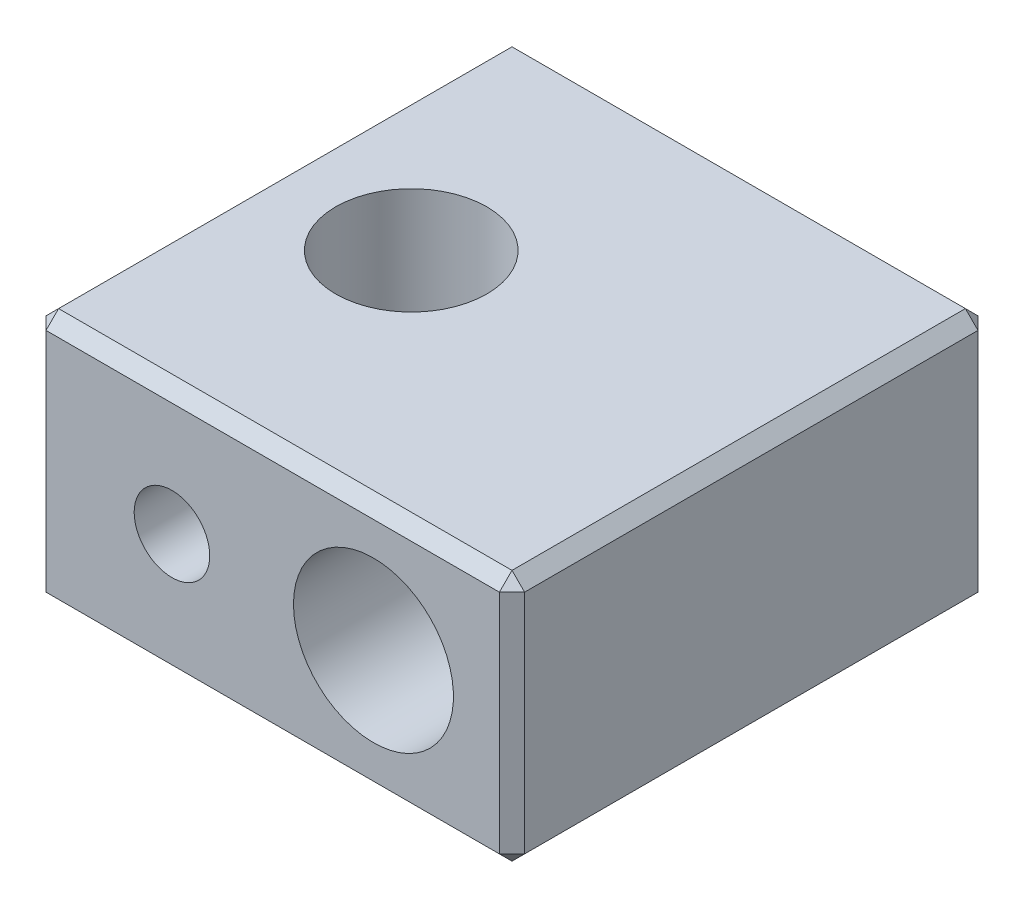
ISO-10303-21;
HEADER;
FILE_DESCRIPTION(('STEP AP214'),'2;1');
FILE_NAME('part.step','',(''),(''),'','','');
FILE_SCHEMA(('AUTOMOTIVE_DESIGN { 1 0 10303 214 1 1 1 1 }'));
ENDSEC;
DATA;
#1=APPLICATION_CONTEXT('core data for automotive mechanical design processes');
#2=APPLICATION_PROTOCOL_DEFINITION('international standard','automotive_design',2000,#1);
#3=PRODUCT_CONTEXT('',#1,'mechanical');
#4=PRODUCT('Part','Part','',(#3));
#5=PRODUCT_RELATED_PRODUCT_CATEGORY('part','',(#4));
#6=PRODUCT_DEFINITION_FORMATION('','',#4);
#7=PRODUCT_DEFINITION_CONTEXT('part definition',#1,'design');
#8=PRODUCT_DEFINITION('design','',#6,#7);
#9=PRODUCT_DEFINITION_SHAPE('','',#8);
#10=(LENGTH_UNIT() NAMED_UNIT(*) SI_UNIT(.MILLI.,.METRE.));
#11=(NAMED_UNIT(*) PLANE_ANGLE_UNIT() SI_UNIT($,.RADIAN.));
#12=(NAMED_UNIT(*) SI_UNIT($,.STERADIAN.) SOLID_ANGLE_UNIT());
#13=UNCERTAINTY_MEASURE_WITH_UNIT(LENGTH_MEASURE(1.E-05),#10,'distance_accuracy_value','');
#14=(GEOMETRIC_REPRESENTATION_CONTEXT(3) GLOBAL_UNCERTAINTY_ASSIGNED_CONTEXT((#13)) GLOBAL_UNIT_ASSIGNED_CONTEXT((#10,
#11,#12)) REPRESENTATION_CONTEXT('',''));
#15=CARTESIAN_POINT('',(0.,0.,0.));
#16=DIRECTION('',(0.,0.,1.));
#17=DIRECTION('',(1.,0.,0.));
#18=AXIS2_PLACEMENT_3D('',#15,#16,#17);
#19=CARTESIAN_POINT('',(-9.5,10.,9.5));
#20=DIRECTION('',(0.,0.,-1.));
#21=DIRECTION('',(-1.,0.,0.));
#22=AXIS2_PLACEMENT_3D('',#19,#20,#21);
#23=PLANE('',#22);
#24=DIRECTION('',(0.,-1.,0.));
#25=VECTOR('',#24,1.);
#26=CARTESIAN_POINT('',(-8.99999999999999,10.,9.5));
#27=LINE('',#26,#25);
#28=CARTESIAN_POINT('',(-8.99999999999999,9.49999999999999,9.5));
#29=VERTEX_POINT('',#28);
#30=CARTESIAN_POINT('',(-8.99999999999999,0.500000000000004,9.5));
#31=VERTEX_POINT('',#30);
#32=EDGE_CURVE('E130',#29,#31,#27,.T.);
#33=ORIENTED_EDGE('',*,*,#32,.T.);
#34=DIRECTION('',(1.,0.,0.));
#35=VECTOR('',#34,1.);
#36=CARTESIAN_POINT('',(-9.5,0.500000000000004,9.5));
#37=LINE('',#36,#35);
#38=CARTESIAN_POINT('',(8.99999999999999,0.500000000000004,9.5));
#39=VERTEX_POINT('',#38);
#40=EDGE_CURVE('E126',#31,#39,#37,.T.);
#41=ORIENTED_EDGE('',*,*,#40,.T.);
#42=DIRECTION('',(0.,1.,0.));
#43=VECTOR('',#42,1.);
#44=CARTESIAN_POINT('',(8.99999999999999,10.,9.5));
#45=LINE('',#44,#43);
#46=CARTESIAN_POINT('',(8.99999999999999,9.49999999999999,9.5));
#47=VERTEX_POINT('',#46);
#48=EDGE_CURVE('E120',#39,#47,#45,.T.);
#49=ORIENTED_EDGE('',*,*,#48,.T.);
#50=DIRECTION('',(-1.,0.,0.));
#51=VECTOR('',#50,1.);
#52=CARTESIAN_POINT('',(-9.5,9.49999999999999,9.5));
#53=LINE('',#52,#51);
#54=EDGE_CURVE('E123',#47,#29,#53,.T.);
#55=ORIENTED_EDGE('',*,*,#54,.T.);
#56=EDGE_LOOP('',(#33,#41,#49,#55));
#57=FACE_BOUND('',#56,.T.);
#58=CARTESIAN_POINT('',(4.,5.,9.5));
#59=DIRECTION('',(0.,0.,-1.));
#60=DIRECTION('',(-1.,0.,0.));
#61=AXIS2_PLACEMENT_3D('',#58,#59,#60);
#62=CIRCLE('',#61,3.175);
#63=CARTESIAN_POINT('',(0.824999999999998,5.,9.5));
#64=VERTEX_POINT('',#63);
#65=EDGE_CURVE('E223',#64,#64,#62,.T.);
#66=ORIENTED_EDGE('',*,*,#65,.T.);
#67=EDGE_LOOP('',(#66));
#68=FACE_BOUND('',#67,.T.);
#69=CARTESIAN_POINT('',(-4.,5.,9.5));
#70=DIRECTION('',(0.,0.,-1.));
#71=DIRECTION('',(-1.,0.,0.));
#72=AXIS2_PLACEMENT_3D('',#69,#70,#71);
#73=CIRCLE('',#72,1.5);
#74=CARTESIAN_POINT('',(-5.5,5.,9.5));
#75=VERTEX_POINT('',#74);
#76=EDGE_CURVE('E199',#75,#75,#73,.T.);
#77=ORIENTED_EDGE('',*,*,#76,.T.);
#78=EDGE_LOOP('',(#77));
#79=FACE_BOUND('',#78,.T.);
#80=ADVANCED_FACE('F32',(#57,#68,#79),#23,.F.);
#81=CARTESIAN_POINT('',(9.5,0.,9.5));
#82=DIRECTION('',(0.,1.,0.));
#83=DIRECTION('',(0.,0.,1.));
#84=AXIS2_PLACEMENT_3D('',#81,#82,#83);
#85=PLANE('',#84);
#86=DIRECTION('',(0.,0.,1.));
#87=VECTOR('',#86,1.);
#88=CARTESIAN_POINT('',(9.,0.,9.5));
#89=LINE('',#88,#87);
#90=CARTESIAN_POINT('',(8.99999999999999,0.,-8.99999999999999));
#91=VERTEX_POINT('',#90);
#92=CARTESIAN_POINT('',(9.,0.,8.99999999999999));
#93=VERTEX_POINT('',#92);
#94=EDGE_CURVE('E359',#91,#93,#89,.T.);
#95=ORIENTED_EDGE('',*,*,#94,.T.);
#96=DIRECTION('',(-1.,0.,0.));
#97=VECTOR('',#96,1.);
#98=CARTESIAN_POINT('',(9.5,0.,8.99999999999999));
#99=LINE('',#98,#97);
#100=CARTESIAN_POINT('',(-8.99999999999999,0.,8.99999999999999));
#101=VERTEX_POINT('',#100);
#102=EDGE_CURVE('E361',#93,#101,#99,.T.);
#103=ORIENTED_EDGE('',*,*,#102,.T.);
#104=DIRECTION('',(0.,0.,-1.));
#105=VECTOR('',#104,1.);
#106=CARTESIAN_POINT('',(-8.99999999999999,0.,9.5));
#107=LINE('',#106,#105);
#108=CARTESIAN_POINT('',(-8.99999999999999,0.,-8.99999999999999));
#109=VERTEX_POINT('',#108);
#110=EDGE_CURVE('E355',#101,#109,#107,.T.);
#111=ORIENTED_EDGE('',*,*,#110,.T.);
#112=DIRECTION('',(1.,0.,0.));
#113=VECTOR('',#112,1.);
#114=CARTESIAN_POINT('',(9.5,0.,-8.99999999999999));
#115=LINE('',#114,#113);
#116=EDGE_CURVE('E357',#109,#91,#115,.T.);
#117=ORIENTED_EDGE('',*,*,#116,.T.);
#118=EDGE_LOOP('',(#95,#103,#111,#117));
#119=FACE_BOUND('',#118,.T.);
#120=CARTESIAN_POINT('',(-4.,0.,0.));
#121=DIRECTION('',(0.,-1.,0.));
#122=DIRECTION('',(0.,0.,-1.));
#123=AXIS2_PLACEMENT_3D('',#120,#121,#122);
#124=CIRCLE('',#123,3.25);
#125=CARTESIAN_POINT('',(-4.,0.,-3.25));
#126=VERTEX_POINT('',#125);
#127=EDGE_CURVE('E425',#126,#126,#124,.T.);
#128=ORIENTED_EDGE('',*,*,#127,.F.);
#129=EDGE_LOOP('',(#128));
#130=FACE_BOUND('',#129,.T.);
#131=CARTESIAN_POINT('',(4.,0.,0.));
#132=DIRECTION('',(0.,1.,0.));
#133=DIRECTION('',(0.,0.,1.));
#134=AXIS2_PLACEMENT_3D('',#131,#132,#133);
#135=CIRCLE('',#134,1.5);
#136=CARTESIAN_POINT('',(4.,0.,1.5));
#137=VERTEX_POINT('',#136);
#138=EDGE_CURVE('E213',#137,#137,#135,.T.);
#139=ORIENTED_EDGE('',*,*,#138,.T.);
#140=EDGE_LOOP('',(#139));
#141=FACE_BOUND('',#140,.T.);
#142=ADVANCED_FACE('F244',(#119,#130,#141),#85,.F.);
#143=CARTESIAN_POINT('',(4.,5.,9.5));
#144=DIRECTION('',(0.,0.,-1.));
#145=DIRECTION('',(-1.,0.,0.));
#146=AXIS2_PLACEMENT_3D('',#143,#144,#145);
#147=CYLINDRICAL_SURFACE('',#146,3.175);
#148=CARTESIAN_POINT('',(4.,5.,-9.5));
#149=DIRECTION('',(0.,0.,-1.));
#150=DIRECTION('',(-1.,0.,0.));
#151=AXIS2_PLACEMENT_3D('',#148,#149,#150);
#152=CIRCLE('',#151,3.175);
#153=CARTESIAN_POINT('',(0.824999999999998,5.,-9.5));
#154=VERTEX_POINT('',#153);
#155=EDGE_CURVE('E216',#154,#154,#152,.T.);
#156=ORIENTED_EDGE('',*,*,#155,.T.);
#157=EDGE_LOOP('',(#156));
#158=FACE_BOUND('',#157,.T.);
#159=ORIENTED_EDGE('',*,*,#65,.F.);
#160=EDGE_LOOP('',(#159));
#161=FACE_BOUND('',#160,.T.);
#162=CARTESIAN_POINT('',(4.,1.825,-1.5));
#163=CARTESIAN_POINT('',(4.07936960563319,1.82500378014705,-1.49999552610351));
#164=CARTESIAN_POINT('',(4.15884896621332,1.82800879629186,-1.49366335348419));
#165=CARTESIAN_POINT('',(4.3154907966577,1.83973237257584,-1.46859961285751));
#166=CARTESIAN_POINT('',(4.39264787604167,1.84846329246751,-1.44984122112576));
#167=CARTESIAN_POINT('',(4.54213461401645,1.8707181485981,-1.40080463386028));
#168=CARTESIAN_POINT('',(4.61448113482697,1.88422416603307,-1.37056947468804));
#169=CARTESIAN_POINT('',(4.75298275747988,1.91476442442062,-1.29964446831745));
#170=CARTESIAN_POINT('',(4.81913879873701,1.93179812877659,-1.25895621091422));
#171=CARTESIAN_POINT('',(4.94753197755139,1.96890784997548,-1.16568662754687));
#172=CARTESIAN_POINT('',(5.00934531536299,1.98910050392611,-1.11256891765261));
#173=CARTESIAN_POINT('',(5.12356872804672,2.02983122248948,-0.997094015418057));
#174=CARTESIAN_POINT('',(5.17597245123061,2.05036951025994,-0.934730633511468));
#175=CARTESIAN_POINT('',(5.27340721108708,2.09104265788839,-0.797484364549707));
#176=CARTESIAN_POINT('',(5.31770529611402,2.11105747093378,-0.722041543144826));
#177=CARTESIAN_POINT('',(5.39279860497068,2.14649805086367,-0.563714506050773));
#178=CARTESIAN_POINT('',(5.4236026358555,2.16192680877126,-0.480835186570921));
#179=CARTESIAN_POINT('',(5.46896762087975,2.18515018476853,-0.31481732997647));
#180=CARTESIAN_POINT('',(5.48434942407678,2.19332754828801,-0.231959104586468));
#181=CARTESIAN_POINT('',(5.50096994970779,2.20217709352757,-0.0644666996695347));
#182=CARTESIAN_POINT('',(5.50222015512641,2.20285536881031,0.0201659819400645));
#183=CARTESIAN_POINT('',(5.49114871052963,2.19694406736192,0.179375308597733));
#184=CARTESIAN_POINT('',(5.48022366031689,2.19110228775897,0.254083159444344));
#185=CARTESIAN_POINT('',(5.44750469243097,2.17410342089286,0.400444680864749));
#186=CARTESIAN_POINT('',(5.42570787921159,2.16294491762807,0.472097532259387));
#187=CARTESIAN_POINT('',(5.37144042107046,2.13631288920667,0.612321457252151));
#188=CARTESIAN_POINT('',(5.33873421633754,2.12074539557425,0.680782693270601));
#189=CARTESIAN_POINT('',(5.26375034917989,2.08705518759843,0.811555770691812));
#190=CARTESIAN_POINT('',(5.22146847336964,2.06893134976761,0.873864887721362));
#191=CARTESIAN_POINT('',(5.12301829304094,2.02972032691525,0.997886017898578));
#192=CARTESIAN_POINT('',(5.06582685913967,2.00852815825586,1.05875534173549));
#193=CARTESIAN_POINT('',(4.94191165452174,1.96723030755263,1.17036692101214));
#194=CARTESIAN_POINT('',(4.87518424052315,1.94712504483319,1.22110528801275));
#195=CARTESIAN_POINT('',(4.73090045194253,1.90934186811578,1.31276553049459));
#196=CARTESIAN_POINT('',(4.65303276474939,1.89178262065809,1.3532501250906));
#197=CARTESIAN_POINT('',(4.49054980640997,1.86204103438622,1.42023485274128));
#198=CARTESIAN_POINT('',(4.40593938939462,1.84985486801759,1.44674494327945));
#199=CARTESIAN_POINT('',(4.23932533118367,1.83301150614484,1.48304672169946));
#200=CARTESIAN_POINT('',(4.15761808537237,1.82784930363547,1.49396302225133));
#201=CARTESIAN_POINT('',(3.99337993762666,1.82394625691096,1.50223450172528));
#202=CARTESIAN_POINT('',(3.91084937990857,1.82520283284867,1.49959512896601));
#203=CARTESIAN_POINT('',(3.75320909524375,1.83368749574601,1.48154104977407));
#204=CARTESIAN_POINT('',(3.67797438273671,1.84050696101403,1.46700031787886));
#205=CARTESIAN_POINT('',(3.53114008861237,1.85893750143806,1.42687253370616));
#206=CARTESIAN_POINT('',(3.45954092924452,1.87054913175455,1.40128420157562));
#207=CARTESIAN_POINT('',(3.3195173353867,1.89793370999513,1.33902722401946));
#208=CARTESIAN_POINT('',(3.25125556630968,1.91382242394619,1.30204540414419));
#209=CARTESIAN_POINT('',(3.12166658688653,1.9481715735434,1.21839457445117));
#210=CARTESIAN_POINT('',(3.06034243754656,1.9666331364222,1.17172131414348));
#211=CARTESIAN_POINT('',(2.94055528499526,2.00625152384082,1.06515983569381));
#212=CARTESIAN_POINT('',(2.88284178298482,2.02750159498701,1.00446196991745));
#213=CARTESIAN_POINT('',(2.77812417836031,2.0689892973599,0.874079956626705));
#214=CARTESIAN_POINT('',(2.73112556156511,2.08922640584945,0.804391234425825));
#215=CARTESIAN_POINT('',(2.6476822639998,2.1270157776171,0.654841394300249));
#216=CARTESIAN_POINT('',(2.6116642516864,2.14444936754207,0.574709723149408));
#217=CARTESIAN_POINT('',(2.55400203348932,2.17320495906616,0.408424263919081));
#218=CARTESIAN_POINT('',(2.53234145021053,2.18453392139114,0.322277461718732));
#219=CARTESIAN_POINT('',(2.50583444641473,2.19851851692831,0.154863402906991));
#220=CARTESIAN_POINT('',(2.49963251148815,2.20187207176707,0.0738695282686648));
#221=CARTESIAN_POINT('',(2.5004008875279,2.20145924129458,-0.0880256718279041));
#222=CARTESIAN_POINT('',(2.50736721668871,2.19769500825225,-0.168927017863447));
#223=CARTESIAN_POINT('',(2.53304452543146,2.1841789062617,-0.321861858166745));
#224=CARTESIAN_POINT('',(2.55081637100025,2.17490706922987,-0.394100315708995));
#225=CARTESIAN_POINT('',(2.59652737888882,2.15192341830404,-0.53452895410737));
#226=CARTESIAN_POINT('',(2.62446960003733,2.13821026878362,-0.6027179098565));
#227=CARTESIAN_POINT('',(2.69183834096165,2.10676566636447,-0.738110551829189));
#228=CARTESIAN_POINT('',(2.73190592465991,2.0888273778811,-0.804945969560304));
#229=CARTESIAN_POINT('',(2.82161930265931,2.05137218308055,-0.931360798184328));
#230=CARTESIAN_POINT('',(2.87126967655845,2.03185452458563,-0.990936717479633));
#231=CARTESIAN_POINT('',(2.98481054622897,1.99101051160812,-1.1075560784686));
#232=CARTESIAN_POINT('',(3.04964445909147,1.96970684763495,-1.16369381341707));
#233=CARTESIAN_POINT('',(3.18849355379877,1.92960939228646,-1.26444175427494));
#234=CARTESIAN_POINT('',(3.26251314986984,1.91081681670608,-1.30904638589811));
#235=CARTESIAN_POINT('',(3.41768967664033,1.87785196490441,-1.3850463197749));
#236=CARTESIAN_POINT('',(3.49882070475343,1.86366373894684,-1.41648733383919));
#237=CARTESIAN_POINT('',(3.66595879751047,1.84150449210771,-1.46490242402554));
#238=CARTESIAN_POINT('',(3.7519506429211,1.83351510637885,-1.48191924759625));
#239=CARTESIAN_POINT('',(3.86555067251037,1.82773333825557,-1.49420643339842));
#240=CARTESIAN_POINT('',(3.89238024918377,1.82671048291779,-1.49637655199677));
#241=CARTESIAN_POINT('',(3.94613566805403,1.82534316483504,-1.49927411038089));
#242=CARTESIAN_POINT('',(3.97306151235319,1.82499871699697,-1.50000151846547));
#243=CARTESIAN_POINT('',(4.,1.825,-1.5));
#244=B_SPLINE_CURVE_WITH_KNOTS('',3,(#162,#163,#164,#165,#166,#167,#168,#169,#170,#171,#172,
#173,#174,#175,#176,#177,#178,#179,#180,#181,#182,#183,#184,#185,#186,#187,#188,#189,#190,#191,
#192,#193,#194,#195,#196,#197,#198,#199,#200,#201,#202,#203,#204,#205,#206,#207,#208,#209,#210,
#211,#212,#213,#214,#215,#216,#217,#218,#219,#220,#221,#222,#223,#224,#225,#226,#227,#228,#229,
#230,#231,#232,#233,#234,#235,#236,#237,#238,#239,#240,#241,#242,#243),.UNSPECIFIED.,.T.,.F.,(4,
2,2,2,2,2,2,2,2,2,2,2,2,2,2,2,2,2,2,2,2,2,2,2,2,2,2,2,2,2,2,2,2,2,2,2,2,2,2,2,4),(0.,
0.237998863435127,0.476513162034361,0.714141760487185,0.951734239756924,1.202566267352,
1.45356698050229,1.72144991719773,1.98915775546694,2.24170968929963,2.4940563909499,
2.72018464462581,2.94637315667184,3.17780125644152,3.40933138528568,3.66670059385932,
3.92416839616743,4.19124985366182,4.45814074508092,4.70459764976704,4.9509555058397,
5.18069145066332,5.41045401730286,5.6472008989094,5.88405183355053,6.14213867221335,
6.40035735120202,6.66760822573517,6.93455372246492,7.17710763594646,7.41958821796887,
7.64352093670395,7.86752106087492,8.10644389425159,8.34548119240929,8.60934561245708,
8.87333732850241,9.13640455025375,9.39868939422999,9.47946576344206,9.56024390756228),.UNSPECIFIED.);
#245=CARTESIAN_POINT('',(4.,1.825,-1.5));
#246=VERTEX_POINT('',#245);
#247=EDGE_CURVE('E210',#246,#246,#244,.T.);
#248=ORIENTED_EDGE('',*,*,#247,.T.);
#249=EDGE_LOOP('',(#248));
#250=FACE_BOUND('',#249,.T.);
#251=ADVANCED_FACE('F249',(#158,#161,#250),#147,.F.);
#252=CARTESIAN_POINT('',(-4.,10.,0.));
#253=DIRECTION('',(0.,-1.,0.));
#254=DIRECTION('',(0.,0.,-1.));
#255=AXIS2_PLACEMENT_3D('',#252,#253,#254);
#256=CYLINDRICAL_SURFACE('',#255,3.);
#257=CARTESIAN_POINT('',(-4.,10.,0.));
#258=DIRECTION('',(0.,1.,0.));
#259=DIRECTION('',(0.,0.,1.));
#260=AXIS2_PLACEMENT_3D('',#257,#258,#259);
#261=CIRCLE('',#260,3.);
#262=CARTESIAN_POINT('',(-4.,10.,3.));
#263=VERTEX_POINT('',#262);
#264=EDGE_CURVE('E141',#263,#263,#261,.T.);
#265=ORIENTED_EDGE('',*,*,#264,.T.);
#266=EDGE_LOOP('',(#265));
#267=FACE_BOUND('',#266,.T.);
#268=CARTESIAN_POINT('',(-4.,1.5,0.));
#269=DIRECTION('',(0.,-1.,0.));
#270=DIRECTION('',(0.,0.,-1.));
#271=AXIS2_PLACEMENT_3D('',#268,#269,#270);
#272=CIRCLE('',#271,3.);
#273=CARTESIAN_POINT('',(-4.,1.5,-3.));
#274=VERTEX_POINT('',#273);
#275=EDGE_CURVE('E430',#274,#274,#272,.T.);
#276=ORIENTED_EDGE('',*,*,#275,.T.);
#277=EDGE_LOOP('',(#276));
#278=FACE_BOUND('',#277,.T.);
#279=ADVANCED_FACE('F437',(#267,#278),#256,.F.);
#280=CARTESIAN_POINT('',(9.5,10.,9.5));
#281=DIRECTION('',(0.,1.,0.));
#282=DIRECTION('',(0.,0.,1.));
#283=AXIS2_PLACEMENT_3D('',#280,#281,#282);
#284=PLANE('',#283);
#285=DIRECTION('',(0.,0.,-1.));
#286=VECTOR('',#285,1.);
#287=CARTESIAN_POINT('',(9.,10.,-9.5));
#288=LINE('',#287,#286);
#289=CARTESIAN_POINT('',(9.,10.,9.));
#290=VERTEX_POINT('',#289);
#291=CARTESIAN_POINT('',(9.,10.,-8.99999999999999));
#292=VERTEX_POINT('',#291);
#293=EDGE_CURVE('E41',#290,#292,#288,.T.);
#294=ORIENTED_EDGE('',*,*,#293,.T.);
#295=DIRECTION('',(-1.,0.,0.));
#296=VECTOR('',#295,1.);
#297=CARTESIAN_POINT('',(-9.5,10.,-8.99999999999999));
#298=LINE('',#297,#296);
#299=CARTESIAN_POINT('',(-8.99999999999999,10.,-8.99999999999999));
#300=VERTEX_POINT('',#299);
#301=EDGE_CURVE('E11',#292,#300,#298,.T.);
#302=ORIENTED_EDGE('',*,*,#301,.T.);
#303=DIRECTION('',(0.,0.,1.));
#304=VECTOR('',#303,1.);
#305=CARTESIAN_POINT('',(-8.99999999999999,10.,9.5));
#306=LINE('',#305,#304);
#307=CARTESIAN_POINT('',(-8.99999999999999,10.,9.));
#308=VERTEX_POINT('',#307);
#309=EDGE_CURVE('E340',#300,#308,#306,.T.);
#310=ORIENTED_EDGE('',*,*,#309,.T.);
#311=DIRECTION('',(1.,0.,0.));
#312=VECTOR('',#311,1.);
#313=CARTESIAN_POINT('',(9.5,10.,9.));
#314=LINE('',#313,#312);
#315=EDGE_CURVE('E52',#308,#290,#314,.T.);
#316=ORIENTED_EDGE('',*,*,#315,.T.);
#317=EDGE_LOOP('',(#294,#302,#310,#316));
#318=FACE_BOUND('',#317,.T.);
#319=ORIENTED_EDGE('',*,*,#264,.F.);
#320=EDGE_LOOP('',(#319));
#321=FACE_BOUND('',#320,.T.);
#322=ADVANCED_FACE('F266',(#318,#321),#284,.T.);
#323=CARTESIAN_POINT('',(9.5,10.,-9.5));
#324=DIRECTION('',(-1.,0.,0.));
#325=DIRECTION('',(0.,0.,1.));
#326=AXIS2_PLACEMENT_3D('',#323,#324,#325);
#327=PLANE('',#326);
#328=DIRECTION('',(0.,-1.,0.));
#329=VECTOR('',#328,1.);
#330=CARTESIAN_POINT('',(9.5,10.,9.));
#331=LINE('',#330,#329);
#332=CARTESIAN_POINT('',(9.5,9.49999999999999,9.));
#333=VERTEX_POINT('',#332);
#334=CARTESIAN_POINT('',(9.5,0.500000000000004,9.));
#335=VERTEX_POINT('',#334);
#336=EDGE_CURVE('E152',#333,#335,#331,.T.);
#337=ORIENTED_EDGE('',*,*,#336,.T.);
#338=DIRECTION('',(0.,0.,-1.));
#339=VECTOR('',#338,1.);
#340=CARTESIAN_POINT('',(9.5,0.500000000000004,-9.5));
#341=LINE('',#340,#339);
#342=CARTESIAN_POINT('',(9.5,0.500000000000004,-8.99999999999999));
#343=VERTEX_POINT('',#342);
#344=EDGE_CURVE('E369',#335,#343,#341,.T.);
#345=ORIENTED_EDGE('',*,*,#344,.T.);
#346=DIRECTION('',(0.,1.,0.));
#347=VECTOR('',#346,1.);
#348=CARTESIAN_POINT('',(9.5,10.,-8.99999999999999));
#349=LINE('',#348,#347);
#350=CARTESIAN_POINT('',(9.5,9.49999999999999,-8.99999999999999));
#351=VERTEX_POINT('',#350);
#352=EDGE_CURVE('E367',#343,#351,#349,.T.);
#353=ORIENTED_EDGE('',*,*,#352,.T.);
#354=DIRECTION('',(0.,0.,1.));
#355=VECTOR('',#354,1.);
#356=CARTESIAN_POINT('',(9.5,9.49999999999999,9.5));
#357=LINE('',#356,#355);
#358=EDGE_CURVE('E364',#351,#333,#357,.T.);
#359=ORIENTED_EDGE('',*,*,#358,.T.);
#360=EDGE_LOOP('',(#337,#345,#353,#359));
#361=FACE_BOUND('',#360,.T.);
#362=ADVANCED_FACE('F262',(#361),#327,.F.);
#363=CARTESIAN_POINT('',(-9.5,10.,-9.5));
#364=DIRECTION('',(0.,0.,1.));
#365=DIRECTION('',(1.,0.,0.));
#366=AXIS2_PLACEMENT_3D('',#363,#364,#365);
#367=PLANE('',#366);
#368=DIRECTION('',(0.,-1.,0.));
#369=VECTOR('',#368,1.);
#370=CARTESIAN_POINT('',(9.,10.,-9.5));
#371=LINE('',#370,#369);
#372=CARTESIAN_POINT('',(9.,9.49999999999999,-9.5));
#373=VERTEX_POINT('',#372);
#374=CARTESIAN_POINT('',(9.,0.500000000000004,-9.5));
#375=VERTEX_POINT('',#374);
#376=EDGE_CURVE('E373',#373,#375,#371,.T.);
#377=ORIENTED_EDGE('',*,*,#376,.T.);
#378=DIRECTION('',(-1.,0.,0.));
#379=VECTOR('',#378,1.);
#380=CARTESIAN_POINT('',(-9.5,0.500000000000004,-9.5));
#381=LINE('',#380,#379);
#382=CARTESIAN_POINT('',(-9.,0.500000000000004,-9.5));
#383=VERTEX_POINT('',#382);
#384=EDGE_CURVE('E377',#375,#383,#381,.T.);
#385=ORIENTED_EDGE('',*,*,#384,.T.);
#386=DIRECTION('',(0.,1.,0.));
#387=VECTOR('',#386,1.);
#388=CARTESIAN_POINT('',(-9.,10.,-9.5));
#389=LINE('',#388,#387);
#390=CARTESIAN_POINT('',(-9.,9.49999999999999,-9.5));
#391=VERTEX_POINT('',#390);
#392=EDGE_CURVE('E375',#383,#391,#389,.T.);
#393=ORIENTED_EDGE('',*,*,#392,.T.);
#394=DIRECTION('',(1.,0.,0.));
#395=VECTOR('',#394,1.);
#396=CARTESIAN_POINT('',(9.5,9.49999999999999,-9.5));
#397=LINE('',#396,#395);
#398=EDGE_CURVE('E338',#391,#373,#397,.T.);
#399=ORIENTED_EDGE('',*,*,#398,.T.);
#400=EDGE_LOOP('',(#377,#385,#393,#399));
#401=FACE_BOUND('',#400,.T.);
#402=ORIENTED_EDGE('',*,*,#155,.F.);
#403=EDGE_LOOP('',(#402));
#404=FACE_BOUND('',#403,.T.);
#405=ADVANCED_FACE('F258',(#401,#404),#367,.F.);
#406=CARTESIAN_POINT('',(-9.5,10.,-9.5));
#407=DIRECTION('',(1.,0.,0.));
#408=DIRECTION('',(0.,0.,-1.));
#409=AXIS2_PLACEMENT_3D('',#406,#407,#408);
#410=PLANE('',#409);
#411=DIRECTION('',(0.,-1.,0.));
#412=VECTOR('',#411,1.);
#413=CARTESIAN_POINT('',(-9.5,10.,-8.99999999999999));
#414=LINE('',#413,#412);
#415=CARTESIAN_POINT('',(-9.5,9.49999999999999,-8.99999999999999));
#416=VERTEX_POINT('',#415);
#417=CARTESIAN_POINT('',(-9.5,0.500000000000007,-8.99999999999999));
#418=VERTEX_POINT('',#417);
#419=EDGE_CURVE('E383',#416,#418,#414,.T.);
#420=ORIENTED_EDGE('',*,*,#419,.T.);
#421=DIRECTION('',(0.,0.,1.));
#422=VECTOR('',#421,1.);
#423=CARTESIAN_POINT('',(-9.5,0.500000000000007,-9.5));
#424=LINE('',#423,#422);
#425=CARTESIAN_POINT('',(-9.5,0.500000000000007,8.99999999999999));
#426=VERTEX_POINT('',#425);
#427=EDGE_CURVE('E342',#418,#426,#424,.T.);
#428=ORIENTED_EDGE('',*,*,#427,.T.);
#429=DIRECTION('',(0.,1.,0.));
#430=VECTOR('',#429,1.);
#431=CARTESIAN_POINT('',(-9.5,10.,8.99999999999999));
#432=LINE('',#431,#430);
#433=CARTESIAN_POINT('',(-9.5,9.49999999999999,8.99999999999999));
#434=VERTEX_POINT('',#433);
#435=EDGE_CURVE('E381',#426,#434,#432,.T.);
#436=ORIENTED_EDGE('',*,*,#435,.T.);
#437=DIRECTION('',(0.,0.,-1.));
#438=VECTOR('',#437,1.);
#439=CARTESIAN_POINT('',(-9.5,9.49999999999999,-9.5));
#440=LINE('',#439,#438);
#441=EDGE_CURVE('E345',#434,#416,#440,.T.);
#442=ORIENTED_EDGE('',*,*,#441,.T.);
#443=EDGE_LOOP('',(#420,#428,#436,#442));
#444=FACE_BOUND('',#443,.T.);
#445=ADVANCED_FACE('F254',(#444),#410,.F.);
#446=CARTESIAN_POINT('',(-4.,1.5,0.));
#447=DIRECTION('',(0.,-1.,0.));
#448=DIRECTION('',(0.,0.,-1.));
#449=AXIS2_PLACEMENT_3D('',#446,#447,#448);
#450=CYLINDRICAL_SURFACE('',#449,3.25);
#451=CARTESIAN_POINT('',(-4.,1.5,0.));
#452=DIRECTION('',(0.,-1.,0.));
#453=DIRECTION('',(0.,0.,-1.));
#454=AXIS2_PLACEMENT_3D('',#451,#452,#453);
#455=CIRCLE('',#454,3.25);
#456=CARTESIAN_POINT('',(-4.,1.5,-3.25));
#457=VERTEX_POINT('',#456);
#458=EDGE_CURVE('E427',#457,#457,#455,.T.);
#459=ORIENTED_EDGE('',*,*,#458,.F.);
#460=EDGE_LOOP('',(#459));
#461=FACE_BOUND('',#460,.T.);
#462=ORIENTED_EDGE('',*,*,#127,.T.);
#463=EDGE_LOOP('',(#462));
#464=FACE_BOUND('',#463,.T.);
#465=ADVANCED_FACE('F257',(#461,#464),#450,.F.);
#466=CARTESIAN_POINT('',(-4.,1.5,0.));
#467=DIRECTION('',(0.,-1.,0.));
#468=DIRECTION('',(0.,0.,-1.));
#469=AXIS2_PLACEMENT_3D('',#466,#467,#468);
#470=PLANE('',#469);
#471=ORIENTED_EDGE('',*,*,#275,.F.);
#472=EDGE_LOOP('',(#471));
#473=FACE_BOUND('',#472,.T.);
#474=ORIENTED_EDGE('',*,*,#458,.T.);
#475=EDGE_LOOP('',(#474));
#476=FACE_BOUND('',#475,.T.);
#477=ADVANCED_FACE('F439',(#473,#476),#470,.T.);
#478=CARTESIAN_POINT('',(4.,10.001,0.));
#479=DIRECTION('',(0.,-1.,0.));
#480=DIRECTION('',(0.,0.,-1.));
#481=AXIS2_PLACEMENT_3D('',#478,#479,#480);
#482=CYLINDRICAL_SURFACE('',#481,1.5);
#483=ORIENTED_EDGE('',*,*,#138,.F.);
#484=EDGE_LOOP('',(#483));
#485=FACE_BOUND('',#484,.T.);
#486=ORIENTED_EDGE('',*,*,#247,.F.);
#487=EDGE_LOOP('',(#486));
#488=FACE_BOUND('',#487,.T.);
#489=ADVANCED_FACE('F225',(#485,#488),#482,.F.);
#490=CARTESIAN_POINT('',(-4.,5.,4.5));
#491=DIRECTION('',(0.,0.,1.));
#492=DIRECTION('',(1.,0.,0.));
#493=AXIS2_PLACEMENT_3D('',#490,#491,#492);
#494=CYLINDRICAL_SURFACE('',#493,1.5);
#495=CARTESIAN_POINT('',(-4.,5.,4.5));
#496=DIRECTION('',(0.,0.,-1.));
#497=DIRECTION('',(-1.,0.,0.));
#498=AXIS2_PLACEMENT_3D('',#495,#496,#497);
#499=CIRCLE('',#498,1.5);
#500=CARTESIAN_POINT('',(-5.5,5.,4.5));
#501=VERTEX_POINT('',#500);
#502=EDGE_CURVE('E205',#501,#501,#499,.T.);
#503=ORIENTED_EDGE('',*,*,#502,.T.);
#504=EDGE_LOOP('',(#503));
#505=FACE_BOUND('',#504,.T.);
#506=ORIENTED_EDGE('',*,*,#76,.F.);
#507=EDGE_LOOP('',(#506));
#508=FACE_BOUND('',#507,.T.);
#509=ADVANCED_FACE('F230',(#505,#508),#494,.F.);
#510=CARTESIAN_POINT('',(-4.,5.,4.5));
#511=DIRECTION('',(0.,0.,-1.));
#512=DIRECTION('',(-1.,0.,0.));
#513=AXIS2_PLACEMENT_3D('',#510,#511,#512);
#514=PLANE('',#513);
#515=ORIENTED_EDGE('',*,*,#502,.F.);
#516=EDGE_LOOP('',(#515));
#517=FACE_BOUND('',#516,.T.);
#518=ADVANCED_FACE('F233',(#517),#514,.F.);
#519=CARTESIAN_POINT('',(9.5,10.,-8.99999999999999));
#520=DIRECTION('',(0.,0.707106781186546,-0.707106781186549));
#521=DIRECTION('',(0.,0.707106781186549,0.707106781186546));
#522=AXIS2_PLACEMENT_3D('',#519,#520,#521);
#523=PLANE('',#522);
#524=DIRECTION('',(0.,-0.707106781186549,-0.707106781186546));
#525=VECTOR('',#524,1.);
#526=CARTESIAN_POINT('',(-9.,9.49999999999999,-9.5));
#527=LINE('',#526,#525);
#528=EDGE_CURVE('E36',#300,#391,#527,.T.);
#529=ORIENTED_EDGE('',*,*,#528,.F.);
#530=ORIENTED_EDGE('',*,*,#301,.F.);
#531=DIRECTION('',(0.,0.707106781186549,0.707106781186546));
#532=VECTOR('',#531,1.);
#533=CARTESIAN_POINT('',(9.,9.75,-9.24999999999999));
#534=LINE('',#533,#532);
#535=EDGE_CURVE('E192',#373,#292,#534,.T.);
#536=ORIENTED_EDGE('',*,*,#535,.F.);
#537=ORIENTED_EDGE('',*,*,#398,.F.);
#538=EDGE_LOOP('',(#529,#530,#536,#537));
#539=FACE_BOUND('',#538,.T.);
#540=ADVANCED_FACE('F34',(#539),#523,.T.);
#541=CARTESIAN_POINT('',(-9.,9.49999999999999,-9.5));
#542=DIRECTION('',(-0.577350269189628,0.577350269189626,-0.577350269189624));
#543=DIRECTION('',(-0.707106781186546,-0.707106781186549,0.));
#544=AXIS2_PLACEMENT_3D('',#541,#542,#543);
#545=PLANE('',#544);
#546=DIRECTION('',(0.707106781186548,0.707106781186548,0.));
#547=VECTOR('',#546,1.);
#548=CARTESIAN_POINT('',(-9.25,9.75,-8.99999999999999));
#549=LINE('',#548,#547);
#550=EDGE_CURVE('E187',#300,#416,#549,.F.);
#551=ORIENTED_EDGE('',*,*,#550,.F.);
#552=ORIENTED_EDGE('',*,*,#528,.T.);
#553=DIRECTION('',(0.707106781186545,0.,-0.70710678118655));
#554=VECTOR('',#553,1.);
#555=CARTESIAN_POINT('',(-9.,9.49999999999999,-9.5));
#556=LINE('',#555,#554);
#557=EDGE_CURVE('E190',#416,#391,#556,.T.);
#558=ORIENTED_EDGE('',*,*,#557,.F.);
#559=EDGE_LOOP('',(#551,#552,#558));
#560=FACE_BOUND('',#559,.T.);
#561=ADVANCED_FACE('F240',(#560),#545,.T.);
#562=CARTESIAN_POINT('',(9.5,9.49999999999999,-8.99999999999999));
#563=DIRECTION('',(0.57735026918963,0.577350269189622,-0.577350269189626));
#564=DIRECTION('',(-0.707106781186545,0.,-0.70710678118655));
#565=AXIS2_PLACEMENT_3D('',#562,#563,#564);
#566=PLANE('',#565);
#567=DIRECTION('',(0.707106781186545,0.,0.70710678118655));
#568=VECTOR('',#567,1.);
#569=CARTESIAN_POINT('',(9.5,9.49999999999999,-8.99999999999999));
#570=LINE('',#569,#568);
#571=EDGE_CURVE('E181',#373,#351,#570,.T.);
#572=ORIENTED_EDGE('',*,*,#571,.F.);
#573=ORIENTED_EDGE('',*,*,#535,.T.);
#574=DIRECTION('',(0.707106781186544,-0.707106781186551,0.));
#575=VECTOR('',#574,1.);
#576=CARTESIAN_POINT('',(9.5,9.49999999999999,-8.99999999999999));
#577=LINE('',#576,#575);
#578=EDGE_CURVE('E184',#351,#292,#577,.F.);
#579=ORIENTED_EDGE('',*,*,#578,.F.);
#580=EDGE_LOOP('',(#572,#573,#579));
#581=FACE_BOUND('',#580,.T.);
#582=ADVANCED_FACE('F329',(#581),#566,.T.);
#583=CARTESIAN_POINT('',(-9.5,10.,-8.99999999999999));
#584=DIRECTION('',(0.70710678118655,0.,0.707106781186545));
#585=DIRECTION('',(0.707106781186545,0.,-0.70710678118655));
#586=AXIS2_PLACEMENT_3D('',#583,#584,#585);
#587=PLANE('',#586);
#588=ORIENTED_EDGE('',*,*,#557,.T.);
#589=ORIENTED_EDGE('',*,*,#392,.F.);
#590=DIRECTION('',(-0.707106781186545,0.,0.70710678118655));
#591=VECTOR('',#590,1.);
#592=CARTESIAN_POINT('',(-9.,0.500000000000004,-9.5));
#593=LINE('',#592,#591);
#594=EDGE_CURVE('E176',#418,#383,#593,.F.);
#595=ORIENTED_EDGE('',*,*,#594,.F.);
#596=ORIENTED_EDGE('',*,*,#419,.F.);
#597=EDGE_LOOP('',(#588,#589,#595,#596));
#598=FACE_BOUND('',#597,.T.);
#599=ADVANCED_FACE('F325',(#598),#587,.F.);
#600=CARTESIAN_POINT('',(-8.99999999999999,10.,9.5));
#601=DIRECTION('',(-0.707106781186547,0.707106781186547,0.));
#602=DIRECTION('',(-0.707106781186548,-0.707106781186548,0.));
#603=AXIS2_PLACEMENT_3D('',#600,#601,#602);
#604=PLANE('',#603);
#605=ORIENTED_EDGE('',*,*,#550,.T.);
#606=ORIENTED_EDGE('',*,*,#441,.F.);
#607=DIRECTION('',(-0.707106781186547,-0.707106781186547,0.));
#608=VECTOR('',#607,1.);
#609=CARTESIAN_POINT('',(-9.5,9.49999999999999,8.99999999999999));
#610=LINE('',#609,#608);
#611=EDGE_CURVE('E173',#308,#434,#610,.T.);
#612=ORIENTED_EDGE('',*,*,#611,.F.);
#613=ORIENTED_EDGE('',*,*,#309,.F.);
#614=EDGE_LOOP('',(#605,#606,#612,#613));
#615=FACE_BOUND('',#614,.T.);
#616=ADVANCED_FACE('F322',(#615),#604,.T.);
#617=CARTESIAN_POINT('',(9.5,10.,9.));
#618=DIRECTION('',(0.,0.707106781186545,0.70710678118655));
#619=DIRECTION('',(0.,-0.70710678118655,0.707106781186545));
#620=AXIS2_PLACEMENT_3D('',#617,#618,#619);
#621=PLANE('',#620);
#622=DIRECTION('',(0.,-0.70710678118655,0.707106781186545));
#623=VECTOR('',#622,1.);
#624=CARTESIAN_POINT('',(8.99999999999999,9.49999999999999,9.5));
#625=LINE('',#624,#623);
#626=EDGE_CURVE('E136',#290,#47,#625,.T.);
#627=ORIENTED_EDGE('',*,*,#626,.F.);
#628=ORIENTED_EDGE('',*,*,#315,.F.);
#629=DIRECTION('',(0.,0.70710678118655,-0.707106781186545));
#630=VECTOR('',#629,1.);
#631=CARTESIAN_POINT('',(-8.99999999999999,9.74999999999999,9.25));
#632=LINE('',#631,#630);
#633=EDGE_CURVE('E139',#29,#308,#632,.T.);
#634=ORIENTED_EDGE('',*,*,#633,.F.);
#635=ORIENTED_EDGE('',*,*,#54,.F.);
#636=EDGE_LOOP('',(#627,#628,#634,#635));
#637=FACE_BOUND('',#636,.T.);
#638=ADVANCED_FACE('F135',(#637),#621,.T.);
#639=CARTESIAN_POINT('',(9.,10.,9.5));
#640=DIRECTION('',(0.707106781186551,0.707106781186544,0.));
#641=DIRECTION('',(-0.707106781186544,0.707106781186551,0.));
#642=AXIS2_PLACEMENT_3D('',#639,#640,#641);
#643=PLANE('',#642);
#644=ORIENTED_EDGE('',*,*,#578,.T.);
#645=ORIENTED_EDGE('',*,*,#293,.F.);
#646=DIRECTION('',(-0.707106781186544,0.707106781186551,0.));
#647=VECTOR('',#646,1.);
#648=CARTESIAN_POINT('',(9.25,9.75,9.));
#649=LINE('',#648,#647);
#650=EDGE_CURVE('E149',#333,#290,#649,.T.);
#651=ORIENTED_EDGE('',*,*,#650,.F.);
#652=ORIENTED_EDGE('',*,*,#358,.F.);
#653=EDGE_LOOP('',(#644,#645,#651,#652));
#654=FACE_BOUND('',#653,.T.);
#655=ADVANCED_FACE('F315',(#654),#643,.T.);
#656=CARTESIAN_POINT('',(9.,10.,-9.5));
#657=DIRECTION('',(-0.70710678118655,0.,0.707106781186545));
#658=DIRECTION('',(0.707106781186545,0.,0.70710678118655));
#659=AXIS2_PLACEMENT_3D('',#656,#657,#658);
#660=PLANE('',#659);
#661=ORIENTED_EDGE('',*,*,#571,.T.);
#662=ORIENTED_EDGE('',*,*,#352,.F.);
#663=DIRECTION('',(-0.707106781186545,0.,-0.70710678118655));
#664=VECTOR('',#663,1.);
#665=CARTESIAN_POINT('',(9.5,0.500000000000004,-8.99999999999999));
#666=LINE('',#665,#664);
#667=EDGE_CURVE('E168',#375,#343,#666,.F.);
#668=ORIENTED_EDGE('',*,*,#667,.F.);
#669=ORIENTED_EDGE('',*,*,#376,.F.);
#670=EDGE_LOOP('',(#661,#662,#668,#669));
#671=FACE_BOUND('',#670,.T.);
#672=ADVANCED_FACE('F311',(#671),#660,.F.);
#673=CARTESIAN_POINT('',(-9.5,0.500000000000004,-9.5));
#674=DIRECTION('',(0.,0.707106781186554,0.707106781186541));
#675=DIRECTION('',(0.,-0.707106781186541,0.707106781186554));
#676=AXIS2_PLACEMENT_3D('',#673,#674,#675);
#677=PLANE('',#676);
#678=DIRECTION('',(0.,0.707106781186541,-0.707106781186554));
#679=VECTOR('',#678,1.);
#680=CARTESIAN_POINT('',(-9.,0.500000000000004,-9.5));
#681=LINE('',#680,#679);
#682=EDGE_CURVE('E178',#383,#109,#681,.F.);
#683=ORIENTED_EDGE('',*,*,#682,.F.);
#684=ORIENTED_EDGE('',*,*,#384,.F.);
#685=DIRECTION('',(0.,-0.707106781186541,0.707106781186554));
#686=VECTOR('',#685,1.);
#687=CARTESIAN_POINT('',(9.,0.250000000000001,-9.24999999999999));
#688=LINE('',#687,#686);
#689=EDGE_CURVE('E165',#91,#375,#688,.F.);
#690=ORIENTED_EDGE('',*,*,#689,.F.);
#691=ORIENTED_EDGE('',*,*,#116,.F.);
#692=EDGE_LOOP('',(#683,#684,#690,#691));
#693=FACE_BOUND('',#692,.T.);
#694=ADVANCED_FACE('F307',(#693),#677,.F.);
#695=CARTESIAN_POINT('',(-9.,0.500000000000004,-9.5));
#696=DIRECTION('',(-0.577350269189626,-0.577350269189632,-0.577350269189618));
#697=DIRECTION('',(0.707106781186551,-0.707106781186544,0.));
#698=AXIS2_PLACEMENT_3D('',#695,#696,#697);
#699=PLANE('',#698);
#700=ORIENTED_EDGE('',*,*,#594,.T.);
#701=ORIENTED_EDGE('',*,*,#682,.T.);
#702=DIRECTION('',(0.707106781186548,-0.707106781186548,0.));
#703=VECTOR('',#702,1.);
#704=CARTESIAN_POINT('',(-9.25,0.250000000000006,-8.99999999999999));
#705=LINE('',#704,#703);
#706=EDGE_CURVE('E157',#418,#109,#705,.T.);
#707=ORIENTED_EDGE('',*,*,#706,.F.);
#708=EDGE_LOOP('',(#700,#701,#707));
#709=FACE_BOUND('',#708,.T.);
#710=ADVANCED_FACE('F303',(#709),#699,.T.);
#711=CARTESIAN_POINT('',(-9.5,9.49999999999999,8.99999999999999));
#712=DIRECTION('',(-0.577350269189628,0.577350269189624,0.577350269189624));
#713=DIRECTION('',(0.707106781186545,0.,0.70710678118655));
#714=AXIS2_PLACEMENT_3D('',#711,#712,#713);
#715=PLANE('',#714);
#716=ORIENTED_EDGE('',*,*,#633,.T.);
#717=ORIENTED_EDGE('',*,*,#611,.T.);
#718=DIRECTION('',(-0.707106781186545,0.,-0.70710678118655));
#719=VECTOR('',#718,1.);
#720=CARTESIAN_POINT('',(-9.5,9.49999999999999,8.99999999999999));
#721=LINE('',#720,#719);
#722=EDGE_CURVE('E153',#29,#434,#721,.T.);
#723=ORIENTED_EDGE('',*,*,#722,.F.);
#724=EDGE_LOOP('',(#716,#717,#723));
#725=FACE_BOUND('',#724,.T.);
#726=ADVANCED_FACE('F300',(#725),#715,.T.);
#727=CARTESIAN_POINT('',(8.99999999999999,9.49999999999999,9.5));
#728=DIRECTION('',(0.577350269189624,0.57735026918962,0.577350269189634));
#729=DIRECTION('',(0.707106781186554,0.,-0.707106781186541));
#730=AXIS2_PLACEMENT_3D('',#727,#728,#729);
#731=PLANE('',#730);
#732=ORIENTED_EDGE('',*,*,#650,.T.);
#733=ORIENTED_EDGE('',*,*,#626,.T.);
#734=DIRECTION('',(-0.707106781186554,0.,0.707106781186541));
#735=VECTOR('',#734,1.);
#736=CARTESIAN_POINT('',(8.99999999999999,9.49999999999999,9.5));
#737=LINE('',#736,#735);
#738=EDGE_CURVE('E146',#333,#47,#737,.T.);
#739=ORIENTED_EDGE('',*,*,#738,.F.);
#740=EDGE_LOOP('',(#732,#733,#739));
#741=FACE_BOUND('',#740,.T.);
#742=ADVANCED_FACE('F145',(#741),#731,.T.);
#743=CARTESIAN_POINT('',(9.5,0.500000000000004,-8.99999999999999));
#744=DIRECTION('',(0.577350269189625,-0.577350269189632,-0.57735026918962));
#745=DIRECTION('',(0.707106781186552,0.707106781186543,0.));
#746=AXIS2_PLACEMENT_3D('',#743,#744,#745);
#747=PLANE('',#746);
#748=ORIENTED_EDGE('',*,*,#689,.T.);
#749=ORIENTED_EDGE('',*,*,#667,.T.);
#750=DIRECTION('',(0.707106781186549,0.707106781186546,0.));
#751=VECTOR('',#750,1.);
#752=CARTESIAN_POINT('',(9.5,0.500000000000004,-8.99999999999999));
#753=LINE('',#752,#751);
#754=EDGE_CURVE('E154',#91,#343,#753,.T.);
#755=ORIENTED_EDGE('',*,*,#754,.F.);
#756=EDGE_LOOP('',(#748,#749,#755));
#757=FACE_BOUND('',#756,.T.);
#758=ADVANCED_FACE('F293',(#757),#747,.T.);
#759=CARTESIAN_POINT('',(-9.5,0.500000000000007,-9.5));
#760=DIRECTION('',(0.707106781186547,0.707106781186547,0.));
#761=DIRECTION('',(-0.707106781186548,0.707106781186548,0.));
#762=AXIS2_PLACEMENT_3D('',#759,#760,#761);
#763=PLANE('',#762);
#764=ORIENTED_EDGE('',*,*,#706,.T.);
#765=ORIENTED_EDGE('',*,*,#110,.F.);
#766=DIRECTION('',(-0.707106781186548,0.707106781186548,0.));
#767=VECTOR('',#766,1.);
#768=CARTESIAN_POINT('',(-8.99999999999999,0.,8.99999999999999));
#769=LINE('',#768,#767);
#770=EDGE_CURVE('E159',#426,#101,#769,.F.);
#771=ORIENTED_EDGE('',*,*,#770,.F.);
#772=ORIENTED_EDGE('',*,*,#427,.F.);
#773=EDGE_LOOP('',(#764,#765,#771,#772));
#774=FACE_BOUND('',#773,.T.);
#775=ADVANCED_FACE('F289',(#774),#763,.F.);
#776=CARTESIAN_POINT('',(-8.99999999999999,10.,9.5));
#777=DIRECTION('',(0.70710678118655,0.,-0.707106781186545));
#778=DIRECTION('',(-0.707106781186545,0.,-0.70710678118655));
#779=AXIS2_PLACEMENT_3D('',#776,#777,#778);
#780=PLANE('',#779);
#781=ORIENTED_EDGE('',*,*,#722,.T.);
#782=ORIENTED_EDGE('',*,*,#435,.F.);
#783=DIRECTION('',(0.707106781186545,0.,0.70710678118655));
#784=VECTOR('',#783,1.);
#785=CARTESIAN_POINT('',(-9.24999999999999,0.500000000000006,9.25));
#786=LINE('',#785,#784);
#787=EDGE_CURVE('E349',#31,#426,#786,.F.);
#788=ORIENTED_EDGE('',*,*,#787,.F.);
#789=ORIENTED_EDGE('',*,*,#32,.F.);
#790=EDGE_LOOP('',(#781,#782,#788,#789));
#791=FACE_BOUND('',#790,.T.);
#792=ADVANCED_FACE('F286',(#791),#780,.F.);
#793=CARTESIAN_POINT('',(9.5,10.,9.));
#794=DIRECTION('',(-0.707106781186541,0.,-0.707106781186554));
#795=DIRECTION('',(-0.707106781186554,0.,0.707106781186541));
#796=AXIS2_PLACEMENT_3D('',#793,#794,#795);
#797=PLANE('',#796);
#798=ORIENTED_EDGE('',*,*,#738,.T.);
#799=ORIENTED_EDGE('',*,*,#48,.F.);
#800=DIRECTION('',(0.707106781186554,0.,-0.707106781186541));
#801=VECTOR('',#800,1.);
#802=CARTESIAN_POINT('',(8.99999999999999,0.500000000000004,9.5));
#803=LINE('',#802,#801);
#804=EDGE_CURVE('E395',#335,#39,#803,.F.);
#805=ORIENTED_EDGE('',*,*,#804,.F.);
#806=ORIENTED_EDGE('',*,*,#336,.F.);
#807=EDGE_LOOP('',(#798,#799,#805,#806));
#808=FACE_BOUND('',#807,.T.);
#809=ADVANCED_FACE('F151',(#808),#797,.F.);
#810=CARTESIAN_POINT('',(9.5,0.500000000000004,-9.5));
#811=DIRECTION('',(-0.707106781186546,0.707106781186549,0.));
#812=DIRECTION('',(-0.707106781186549,-0.707106781186546,0.));
#813=AXIS2_PLACEMENT_3D('',#810,#811,#812);
#814=PLANE('',#813);
#815=ORIENTED_EDGE('',*,*,#754,.T.);
#816=ORIENTED_EDGE('',*,*,#344,.F.);
#817=DIRECTION('',(-0.707106781186549,-0.707106781186546,0.));
#818=VECTOR('',#817,1.);
#819=CARTESIAN_POINT('',(9.25,0.250000000000001,8.99999999999999));
#820=LINE('',#819,#818);
#821=EDGE_CURVE('E392',#93,#335,#820,.F.);
#822=ORIENTED_EDGE('',*,*,#821,.F.);
#823=ORIENTED_EDGE('',*,*,#94,.F.);
#824=EDGE_LOOP('',(#815,#816,#822,#823));
#825=FACE_BOUND('',#824,.T.);
#826=ADVANCED_FACE('F279',(#825),#814,.F.);
#827=CARTESIAN_POINT('',(-8.99999999999999,0.,8.99999999999999));
#828=DIRECTION('',(-0.577350269189628,-0.577350269189628,0.57735026918962));
#829=DIRECTION('',(0.707106781186548,-0.707106781186548,0.));
#830=AXIS2_PLACEMENT_3D('',#827,#828,#829);
#831=PLANE('',#830);
#832=ORIENTED_EDGE('',*,*,#787,.T.);
#833=ORIENTED_EDGE('',*,*,#770,.T.);
#834=DIRECTION('',(0.,-0.707106781186545,-0.70710678118655));
#835=VECTOR('',#834,1.);
#836=CARTESIAN_POINT('',(-8.99999999999999,0.,8.99999999999999));
#837=LINE('',#836,#835);
#838=EDGE_CURVE('E390',#31,#101,#837,.T.);
#839=ORIENTED_EDGE('',*,*,#838,.F.);
#840=EDGE_LOOP('',(#832,#833,#839));
#841=FACE_BOUND('',#840,.T.);
#842=ADVANCED_FACE('F275',(#841),#831,.T.);
#843=CARTESIAN_POINT('',(8.99999999999999,0.500000000000004,9.5));
#844=DIRECTION('',(0.57735026918962,-0.577350269189628,0.57735026918963));
#845=DIRECTION('',(0.,-0.707106781186549,-0.707106781186546));
#846=AXIS2_PLACEMENT_3D('',#843,#844,#845);
#847=PLANE('',#846);
#848=ORIENTED_EDGE('',*,*,#821,.T.);
#849=ORIENTED_EDGE('',*,*,#804,.T.);
#850=DIRECTION('',(0.,0.707106781186545,0.70710678118655));
#851=VECTOR('',#850,1.);
#852=CARTESIAN_POINT('',(8.99999999999999,0.500000000000004,9.5));
#853=LINE('',#852,#851);
#854=EDGE_CURVE('E388',#93,#39,#853,.T.);
#855=ORIENTED_EDGE('',*,*,#854,.F.);
#856=EDGE_LOOP('',(#848,#849,#855));
#857=FACE_BOUND('',#856,.T.);
#858=ADVANCED_FACE('F271',(#857),#847,.T.);
#859=CARTESIAN_POINT('',(-9.5,0.500000000000004,9.5));
#860=DIRECTION('',(0.,0.70710678118655,-0.707106781186545));
#861=DIRECTION('',(0.,0.707106781186545,0.70710678118655));
#862=AXIS2_PLACEMENT_3D('',#859,#860,#861);
#863=PLANE('',#862);
#864=ORIENTED_EDGE('',*,*,#838,.T.);
#865=ORIENTED_EDGE('',*,*,#102,.F.);
#866=ORIENTED_EDGE('',*,*,#854,.T.);
#867=ORIENTED_EDGE('',*,*,#40,.F.);
#868=EDGE_LOOP('',(#864,#865,#866,#867));
#869=FACE_BOUND('',#868,.T.);
#870=ADVANCED_FACE('F268',(#869),#863,.F.);
#871=CLOSED_SHELL('',(#80,#142,#251,#279,#322,#362,#405,#445,#465,#477,#489,#509,#518,#540,#561,
#582,#599,#616,#638,#655,#672,#694,#710,#726,#742,#758,#775,#792,#809,#826,#842,#858,#870));
#872=MANIFOLD_SOLID_BREP('B2',#871);
#873=ADVANCED_BREP_SHAPE_REPRESENTATION('',(#18,#872),#14);
#874=SHAPE_DEFINITION_REPRESENTATION(#9,#873);
ENDSEC;
END-ISO-10303-21;
